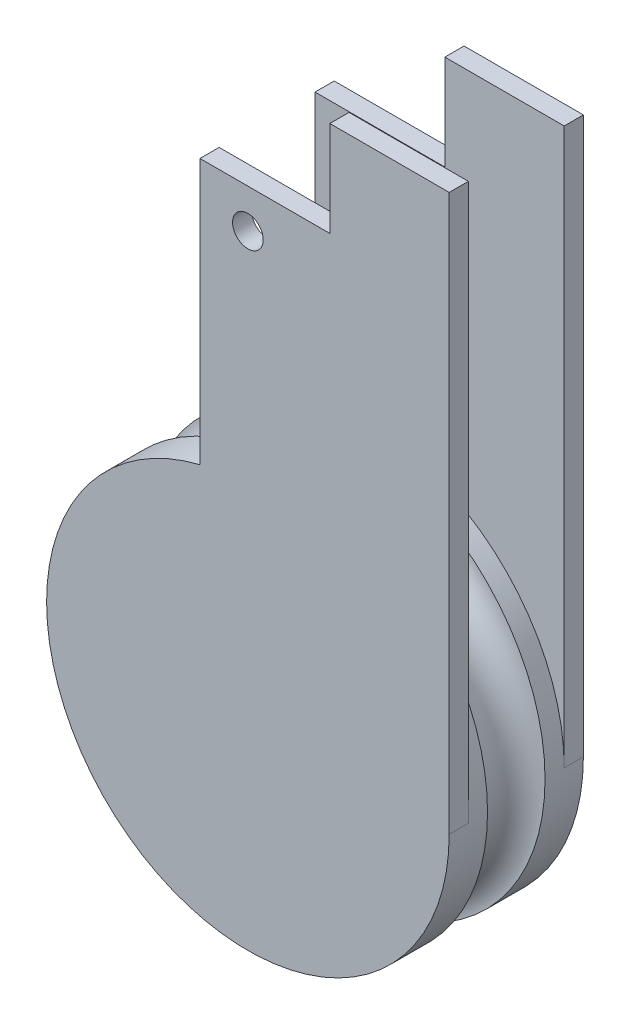
ISO-10303-21;
HEADER;
FILE_DESCRIPTION(('STEP AP214'),'2;1');
FILE_NAME('part.step','',(''),(''),'','','');
FILE_SCHEMA(('AUTOMOTIVE_DESIGN { 1 0 10303 214 1 1 1 1 }'));
ENDSEC;
DATA;
#1=APPLICATION_CONTEXT('core data for automotive mechanical design processes');
#2=APPLICATION_PROTOCOL_DEFINITION('international standard','automotive_design',2000,#1);
#3=PRODUCT_CONTEXT('',#1,'mechanical');
#4=PRODUCT('Part','Part','',(#3));
#5=PRODUCT_RELATED_PRODUCT_CATEGORY('part','',(#4));
#6=PRODUCT_DEFINITION_FORMATION('','',#4);
#7=PRODUCT_DEFINITION_CONTEXT('part definition',#1,'design');
#8=PRODUCT_DEFINITION('design','',#6,#7);
#9=PRODUCT_DEFINITION_SHAPE('','',#8);
#10=(LENGTH_UNIT() NAMED_UNIT(*) SI_UNIT(.MILLI.,.METRE.));
#11=(NAMED_UNIT(*) PLANE_ANGLE_UNIT() SI_UNIT($,.RADIAN.));
#12=(NAMED_UNIT(*) SI_UNIT($,.STERADIAN.) SOLID_ANGLE_UNIT());
#13=UNCERTAINTY_MEASURE_WITH_UNIT(LENGTH_MEASURE(1.E-05),#10,'distance_accuracy_value','');
#14=(GEOMETRIC_REPRESENTATION_CONTEXT(3) GLOBAL_UNCERTAINTY_ASSIGNED_CONTEXT((#13)) GLOBAL_UNIT_ASSIGNED_CONTEXT((#10,
#11,#12)) REPRESENTATION_CONTEXT('',''));
#15=CARTESIAN_POINT('',(0.,0.,0.));
#16=DIRECTION('',(0.,0.,1.));
#17=DIRECTION('',(1.,0.,0.));
#18=AXIS2_PLACEMENT_3D('',#15,#16,#17);
#19=CARTESIAN_POINT('',(0.,0.,5.));
#20=DIRECTION('',(0.,0.,-1.));
#21=DIRECTION('',(-1.,0.,0.));
#22=AXIS2_PLACEMENT_3D('',#19,#20,#21);
#23=CYLINDRICAL_SURFACE('',#22,105.);
#24=CARTESIAN_POINT('',(0.,0.,55.));
#25=DIRECTION('',(0.,0.,1.));
#26=DIRECTION('',(1.,0.,0.));
#27=AXIS2_PLACEMENT_3D('',#24,#25,#26);
#28=CIRCLE('',#27,105.);
#29=CARTESIAN_POINT('',(105.,0.,55.));
#30=VERTEX_POINT('',#29);
#31=CARTESIAN_POINT('',(-25.0000000000001,101.980390271856,55.));
#32=VERTEX_POINT('',#31);
#33=EDGE_CURVE('E83',#30,#32,#28,.T.);
#34=ORIENTED_EDGE('',*,*,#33,.F.);
#35=DIRECTION('',(0.,0.,-1.));
#36=VECTOR('',#35,1.);
#37=CARTESIAN_POINT('',(105.,0.,65.));
#38=LINE('',#37,#36);
#39=CARTESIAN_POINT('',(105.,0.,65.));
#40=VERTEX_POINT('',#39);
#41=EDGE_CURVE('E243',#40,#30,#38,.T.);
#42=ORIENTED_EDGE('',*,*,#41,.F.);
#43=CARTESIAN_POINT('',(0.,0.,65.));
#44=DIRECTION('',(0.,0.,1.));
#45=DIRECTION('',(1.,0.,0.));
#46=AXIS2_PLACEMENT_3D('',#43,#44,#45);
#47=CIRCLE('',#46,105.);
#48=CARTESIAN_POINT('',(-25.0000000000001,101.980390271856,65.));
#49=VERTEX_POINT('',#48);
#50=EDGE_CURVE('E207',#49,#40,#47,.T.);
#51=ORIENTED_EDGE('',*,*,#50,.F.);
#52=DIRECTION('',(0.,0.,-1.));
#53=VECTOR('',#52,1.);
#54=CARTESIAN_POINT('',(-25.0000000000001,101.980390271856,65.));
#55=LINE('',#54,#53);
#56=EDGE_CURVE('E241',#49,#32,#55,.T.);
#57=ORIENTED_EDGE('',*,*,#56,.T.);
#58=EDGE_LOOP('',(#34,#42,#51,#57));
#59=FACE_BOUND('',#58,.T.);
#60=CARTESIAN_POINT('',(0.,0.,45.));
#61=DIRECTION('',(0.,0.,-1.));
#62=DIRECTION('',(-1.,0.,0.));
#63=AXIS2_PLACEMENT_3D('',#60,#61,#62);
#64=CIRCLE('',#63,105.);
#65=CARTESIAN_POINT('',(-105.,0.,45.));
#66=VERTEX_POINT('',#65);
#67=EDGE_CURVE('E70',#66,#66,#64,.T.);
#68=ORIENTED_EDGE('',*,*,#67,.F.);
#69=EDGE_LOOP('',(#68));
#70=FACE_BOUND('',#69,.T.);
#71=ADVANCED_FACE('F67',(#59,#70),#23,.T.);
#72=CARTESIAN_POINT('',(0.,0.,55.));
#73=DIRECTION('',(0.,0.,1.));
#74=DIRECTION('',(1.,0.,0.));
#75=AXIS2_PLACEMENT_3D('',#72,#73,#74);
#76=PLANE('',#75);
#77=CARTESIAN_POINT('',(0.,220.,55.));
#78=DIRECTION('',(0.,0.,1.));
#79=DIRECTION('',(1.,0.,0.));
#80=AXIS2_PLACEMENT_3D('',#77,#78,#79);
#81=CIRCLE('',#80,8.);
#82=CARTESIAN_POINT('',(8.,220.,55.));
#83=VERTEX_POINT('',#82);
#84=EDGE_CURVE('E188',#83,#83,#81,.T.);
#85=ORIENTED_EDGE('',*,*,#84,.T.);
#86=EDGE_LOOP('',(#85));
#87=FACE_BOUND('',#86,.T.);
#88=DIRECTION('',(0.,-1.,0.));
#89=VECTOR('',#88,1.);
#90=CARTESIAN_POINT('',(105.,0.,55.));
#91=LINE('',#90,#89);
#92=CARTESIAN_POINT('',(105.,290.,55.));
#93=VERTEX_POINT('',#92);
#94=EDGE_CURVE('E222',#93,#30,#91,.T.);
#95=ORIENTED_EDGE('',*,*,#94,.T.);
#96=ORIENTED_EDGE('',*,*,#33,.T.);
#97=DIRECTION('',(0.,1.,0.));
#98=VECTOR('',#97,1.);
#99=CARTESIAN_POINT('',(-25.,0.,55.));
#100=LINE('',#99,#98);
#101=CARTESIAN_POINT('',(-25.0000000000001,240.330386365288,55.));
#102=VERTEX_POINT('',#101);
#103=EDGE_CURVE('E224',#32,#102,#100,.T.);
#104=ORIENTED_EDGE('',*,*,#103,.T.);
#105=DIRECTION('',(-1.,0.,0.));
#106=VECTOR('',#105,1.);
#107=CARTESIAN_POINT('',(0.,240.330386365288,55.));
#108=LINE('',#107,#106);
#109=CARTESIAN_POINT('',(42.7404770746346,240.330386365288,55.));
#110=VERTEX_POINT('',#109);
#111=EDGE_CURVE('E226',#110,#102,#108,.T.);
#112=ORIENTED_EDGE('',*,*,#111,.F.);
#113=DIRECTION('',(0.,-1.,0.));
#114=VECTOR('',#113,1.);
#115=CARTESIAN_POINT('',(42.7404770746346,0.,55.));
#116=LINE('',#115,#114);
#117=CARTESIAN_POINT('',(42.7404770746346,290.,55.));
#118=VERTEX_POINT('',#117);
#119=EDGE_CURVE('E204',#118,#110,#116,.T.);
#120=ORIENTED_EDGE('',*,*,#119,.F.);
#121=DIRECTION('',(1.,0.,0.));
#122=VECTOR('',#121,1.);
#123=CARTESIAN_POINT('',(0.,290.,55.));
#124=LINE('',#123,#122);
#125=EDGE_CURVE('E197',#118,#93,#124,.T.);
#126=ORIENTED_EDGE('',*,*,#125,.T.);
#127=EDGE_LOOP('',(#95,#96,#104,#112,#120,#126));
#128=FACE_BOUND('',#127,.T.);
#129=ADVANCED_FACE('F308',(#87,#128),#76,.F.);
#130=CARTESIAN_POINT('',(0.,0.,65.));
#131=DIRECTION('',(0.,0.,1.));
#132=DIRECTION('',(1.,0.,0.));
#133=AXIS2_PLACEMENT_3D('',#130,#131,#132);
#134=PLANE('',#133);
#135=DIRECTION('',(1.,0.,0.));
#136=VECTOR('',#135,1.);
#137=CARTESIAN_POINT('',(0.,290.,65.));
#138=LINE('',#137,#136);
#139=CARTESIAN_POINT('',(42.7404770746346,290.,65.));
#140=VERTEX_POINT('',#139);
#141=CARTESIAN_POINT('',(105.,290.,65.));
#142=VERTEX_POINT('',#141);
#143=EDGE_CURVE('E200',#140,#142,#138,.T.);
#144=ORIENTED_EDGE('',*,*,#143,.F.);
#145=DIRECTION('',(0.,-1.,0.));
#146=VECTOR('',#145,1.);
#147=CARTESIAN_POINT('',(42.7404770746346,0.,65.));
#148=LINE('',#147,#146);
#149=CARTESIAN_POINT('',(42.7404770746346,240.330386365288,65.));
#150=VERTEX_POINT('',#149);
#151=EDGE_CURVE('E216',#140,#150,#148,.T.);
#152=ORIENTED_EDGE('',*,*,#151,.T.);
#153=DIRECTION('',(-1.,0.,0.));
#154=VECTOR('',#153,1.);
#155=CARTESIAN_POINT('',(0.,240.330386365288,65.));
#156=LINE('',#155,#154);
#157=CARTESIAN_POINT('',(-25.0000000000001,240.330386365288,65.));
#158=VERTEX_POINT('',#157);
#159=EDGE_CURVE('E213',#150,#158,#156,.T.);
#160=ORIENTED_EDGE('',*,*,#159,.T.);
#161=DIRECTION('',(0.,1.,0.));
#162=VECTOR('',#161,1.);
#163=CARTESIAN_POINT('',(-25.,0.,65.));
#164=LINE('',#163,#162);
#165=EDGE_CURVE('E210',#49,#158,#164,.T.);
#166=ORIENTED_EDGE('',*,*,#165,.F.);
#167=ORIENTED_EDGE('',*,*,#50,.T.);
#168=DIRECTION('',(0.,-1.,0.));
#169=VECTOR('',#168,1.);
#170=CARTESIAN_POINT('',(105.,0.,65.));
#171=LINE('',#170,#169);
#172=EDGE_CURVE('E203',#142,#40,#171,.T.);
#173=ORIENTED_EDGE('',*,*,#172,.F.);
#174=EDGE_LOOP('',(#144,#152,#160,#166,#167,#173));
#175=FACE_BOUND('',#174,.T.);
#176=CARTESIAN_POINT('',(0.,220.,65.));
#177=DIRECTION('',(0.,0.,1.));
#178=DIRECTION('',(1.,0.,0.));
#179=AXIS2_PLACEMENT_3D('',#176,#177,#178);
#180=CIRCLE('',#179,8.);
#181=CARTESIAN_POINT('',(8.,220.,65.));
#182=VERTEX_POINT('',#181);
#183=EDGE_CURVE('E192',#182,#182,#180,.T.);
#184=ORIENTED_EDGE('',*,*,#183,.F.);
#185=EDGE_LOOP('',(#184));
#186=FACE_BOUND('',#185,.T.);
#187=ADVANCED_FACE('F293',(#175,#186),#134,.T.);
#188=CARTESIAN_POINT('',(0.,290.,65.));
#189=DIRECTION('',(0.,1.,0.));
#190=DIRECTION('',(0.,0.,1.));
#191=AXIS2_PLACEMENT_3D('',#188,#189,#190);
#192=PLANE('',#191);
#193=ORIENTED_EDGE('',*,*,#125,.F.);
#194=DIRECTION('',(0.,0.,-1.));
#195=VECTOR('',#194,1.);
#196=CARTESIAN_POINT('',(42.7404770746346,290.,65.));
#197=LINE('',#196,#195);
#198=EDGE_CURVE('E231',#140,#118,#197,.T.);
#199=ORIENTED_EDGE('',*,*,#198,.F.);
#200=ORIENTED_EDGE('',*,*,#143,.T.);
#201=DIRECTION('',(0.,0.,-1.));
#202=VECTOR('',#201,1.);
#203=CARTESIAN_POINT('',(105.,290.,65.));
#204=LINE('',#203,#202);
#205=EDGE_CURVE('E219',#142,#93,#204,.T.);
#206=ORIENTED_EDGE('',*,*,#205,.T.);
#207=EDGE_LOOP('',(#193,#199,#200,#206));
#208=FACE_BOUND('',#207,.T.);
#209=ADVANCED_FACE('F306',(#208),#192,.T.);
#210=CARTESIAN_POINT('',(42.7404770746346,0.,65.));
#211=DIRECTION('',(1.,0.,0.));
#212=DIRECTION('',(0.,0.,-1.));
#213=AXIS2_PLACEMENT_3D('',#210,#211,#212);
#214=PLANE('',#213);
#215=ORIENTED_EDGE('',*,*,#119,.T.);
#216=DIRECTION('',(0.,0.,-1.));
#217=VECTOR('',#216,1.);
#218=CARTESIAN_POINT('',(42.7404770746346,240.330386365288,65.));
#219=LINE('',#218,#217);
#220=EDGE_CURVE('E235',#150,#110,#219,.T.);
#221=ORIENTED_EDGE('',*,*,#220,.F.);
#222=ORIENTED_EDGE('',*,*,#151,.F.);
#223=ORIENTED_EDGE('',*,*,#198,.T.);
#224=EDGE_LOOP('',(#215,#221,#222,#223));
#225=FACE_BOUND('',#224,.T.);
#226=ADVANCED_FACE('F309',(#225),#214,.F.);
#227=CARTESIAN_POINT('',(0.,240.330386365288,65.));
#228=DIRECTION('',(0.,-1.,0.));
#229=DIRECTION('',(0.,0.,-1.));
#230=AXIS2_PLACEMENT_3D('',#227,#228,#229);
#231=PLANE('',#230);
#232=ORIENTED_EDGE('',*,*,#111,.T.);
#233=DIRECTION('',(0.,0.,-1.));
#234=VECTOR('',#233,1.);
#235=CARTESIAN_POINT('',(-25.0000000000001,240.330386365288,65.));
#236=LINE('',#235,#234);
#237=EDGE_CURVE('E238',#158,#102,#236,.T.);
#238=ORIENTED_EDGE('',*,*,#237,.F.);
#239=ORIENTED_EDGE('',*,*,#159,.F.);
#240=ORIENTED_EDGE('',*,*,#220,.T.);
#241=EDGE_LOOP('',(#232,#238,#239,#240));
#242=FACE_BOUND('',#241,.T.);
#243=ADVANCED_FACE('F297',(#242),#231,.F.);
#244=CARTESIAN_POINT('',(-25.,0.,65.));
#245=DIRECTION('',(-1.,0.,0.));
#246=DIRECTION('',(0.,-1.,0.));
#247=AXIS2_PLACEMENT_3D('',#244,#245,#246);
#248=PLANE('',#247);
#249=ORIENTED_EDGE('',*,*,#103,.F.);
#250=ORIENTED_EDGE('',*,*,#56,.F.);
#251=ORIENTED_EDGE('',*,*,#165,.T.);
#252=ORIENTED_EDGE('',*,*,#237,.T.);
#253=EDGE_LOOP('',(#249,#250,#251,#252));
#254=FACE_BOUND('',#253,.T.);
#255=ADVANCED_FACE('F301',(#254),#248,.T.);
#256=CARTESIAN_POINT('',(105.,0.,65.));
#257=DIRECTION('',(1.,0.,0.));
#258=DIRECTION('',(0.,1.,0.));
#259=AXIS2_PLACEMENT_3D('',#256,#257,#258);
#260=PLANE('',#259);
#261=ORIENTED_EDGE('',*,*,#94,.F.);
#262=ORIENTED_EDGE('',*,*,#205,.F.);
#263=ORIENTED_EDGE('',*,*,#172,.T.);
#264=ORIENTED_EDGE('',*,*,#41,.T.);
#265=EDGE_LOOP('',(#261,#262,#263,#264));
#266=FACE_BOUND('',#265,.T.);
#267=ADVANCED_FACE('F307',(#266),#260,.T.);
#268=CARTESIAN_POINT('',(0.,220.,65.));
#269=DIRECTION('',(0.,0.,-1.));
#270=DIRECTION('',(-1.,0.,0.));
#271=AXIS2_PLACEMENT_3D('',#268,#269,#270);
#272=CYLINDRICAL_SURFACE('',#271,8.);
#273=ORIENTED_EDGE('',*,*,#183,.T.);
#274=EDGE_LOOP('',(#273));
#275=FACE_BOUND('',#274,.T.);
#276=ORIENTED_EDGE('',*,*,#84,.F.);
#277=EDGE_LOOP('',(#276));
#278=FACE_BOUND('',#277,.T.);
#279=ADVANCED_FACE('F423',(#275,#278),#272,.F.);
#280=CARTESIAN_POINT('',(0.,0.,30.));
#281=DIRECTION('',(0.,0.,1.));
#282=DIRECTION('',(1.,0.,0.));
#283=AXIS2_PLACEMENT_3D('',#280,#281,#282);
#284=TOROIDAL_SURFACE('',#283,105.,15.);
#285=CARTESIAN_POINT('',(0.,0.,15.));
#286=DIRECTION('',(0.,0.,1.));
#287=DIRECTION('',(1.,0.,0.));
#288=AXIS2_PLACEMENT_3D('',#285,#286,#287);
#289=CIRCLE('',#288,105.);
#290=CARTESIAN_POINT('',(105.,0.,15.));
#291=VERTEX_POINT('',#290);
#292=EDGE_CURVE('E183',#291,#291,#289,.T.);
#293=ORIENTED_EDGE('',*,*,#292,.T.);
#294=EDGE_LOOP('',(#293));
#295=FACE_BOUND('',#294,.T.);
#296=ORIENTED_EDGE('',*,*,#67,.T.);
#297=EDGE_LOOP('',(#296));
#298=FACE_BOUND('',#297,.T.);
#299=ADVANCED_FACE('F342',(#295,#298),#284,.F.);
#300=CARTESIAN_POINT('',(0.,220.,5.));
#301=DIRECTION('',(0.,0.,-1.));
#302=DIRECTION('',(-1.,0.,0.));
#303=AXIS2_PLACEMENT_3D('',#300,#301,#302);
#304=CYLINDRICAL_SURFACE('',#303,8.);
#305=CARTESIAN_POINT('',(0.,220.,5.));
#306=DIRECTION('',(0.,0.,1.));
#307=DIRECTION('',(1.,0.,0.));
#308=AXIS2_PLACEMENT_3D('',#305,#306,#307);
#309=CIRCLE('',#308,8.);
#310=CARTESIAN_POINT('',(8.,220.,5.));
#311=VERTEX_POINT('',#310);
#312=EDGE_CURVE('E157',#311,#311,#309,.T.);
#313=ORIENTED_EDGE('',*,*,#312,.T.);
#314=EDGE_LOOP('',(#313));
#315=FACE_BOUND('',#314,.T.);
#316=CARTESIAN_POINT('',(0.,220.,-5.));
#317=DIRECTION('',(0.,0.,1.));
#318=DIRECTION('',(1.,0.,0.));
#319=AXIS2_PLACEMENT_3D('',#316,#317,#318);
#320=CIRCLE('',#319,8.);
#321=CARTESIAN_POINT('',(8.,220.,-5.));
#322=VERTEX_POINT('',#321);
#323=EDGE_CURVE('E176',#322,#322,#320,.T.);
#324=ORIENTED_EDGE('',*,*,#323,.F.);
#325=EDGE_LOOP('',(#324));
#326=FACE_BOUND('',#325,.T.);
#327=ADVANCED_FACE('F338',(#315,#326),#304,.F.);
#328=CARTESIAN_POINT('',(0.,290.,5.));
#329=DIRECTION('',(0.,-1.,0.));
#330=DIRECTION('',(0.,0.,-1.));
#331=AXIS2_PLACEMENT_3D('',#328,#329,#330);
#332=PLANE('',#331);
#333=DIRECTION('',(-1.,0.,0.));
#334=VECTOR('',#333,1.);
#335=CARTESIAN_POINT('',(0.,290.,-5.));
#336=LINE('',#335,#334);
#337=CARTESIAN_POINT('',(105.,290.,-5.));
#338=VERTEX_POINT('',#337);
#339=CARTESIAN_POINT('',(42.7404770746346,290.,-5.));
#340=VERTEX_POINT('',#339);
#341=EDGE_CURVE('E169',#338,#340,#336,.T.);
#342=ORIENTED_EDGE('',*,*,#341,.T.);
#343=DIRECTION('',(0.,0.,-1.));
#344=VECTOR('',#343,1.);
#345=CARTESIAN_POINT('',(42.7404770746346,290.,5.));
#346=LINE('',#345,#344);
#347=CARTESIAN_POINT('',(42.7404770746346,290.,5.));
#348=VERTEX_POINT('',#347);
#349=EDGE_CURVE('E145',#348,#340,#346,.T.);
#350=ORIENTED_EDGE('',*,*,#349,.F.);
#351=DIRECTION('',(-1.,0.,0.));
#352=VECTOR('',#351,1.);
#353=CARTESIAN_POINT('',(0.,290.,5.));
#354=LINE('',#353,#352);
#355=CARTESIAN_POINT('',(105.,290.,5.));
#356=VERTEX_POINT('',#355);
#357=EDGE_CURVE('E152',#356,#348,#354,.T.);
#358=ORIENTED_EDGE('',*,*,#357,.F.);
#359=DIRECTION('',(0.,0.,-1.));
#360=VECTOR('',#359,1.);
#361=CARTESIAN_POINT('',(105.,290.,5.));
#362=LINE('',#361,#360);
#363=EDGE_CURVE('E75',#356,#338,#362,.T.);
#364=ORIENTED_EDGE('',*,*,#363,.T.);
#365=EDGE_LOOP('',(#342,#350,#358,#364));
#366=FACE_BOUND('',#365,.T.);
#367=ADVANCED_FACE('F341',(#366),#332,.F.);
#368=CARTESIAN_POINT('',(42.7404770746346,0.,5.));
#369=DIRECTION('',(-1.,0.,0.));
#370=DIRECTION('',(0.,0.,1.));
#371=AXIS2_PLACEMENT_3D('',#368,#369,#370);
#372=PLANE('',#371);
#373=DIRECTION('',(0.,1.,0.));
#374=VECTOR('',#373,1.);
#375=CARTESIAN_POINT('',(42.7404770746346,0.,-5.));
#376=LINE('',#375,#374);
#377=CARTESIAN_POINT('',(42.7404770746346,240.330386365288,-5.));
#378=VERTEX_POINT('',#377);
#379=EDGE_CURVE('E140',#378,#340,#376,.T.);
#380=ORIENTED_EDGE('',*,*,#379,.F.);
#381=DIRECTION('',(0.,0.,-1.));
#382=VECTOR('',#381,1.);
#383=CARTESIAN_POINT('',(42.7404770746346,240.330386365288,5.));
#384=LINE('',#383,#382);
#385=CARTESIAN_POINT('',(42.7404770746346,240.330386365288,5.));
#386=VERTEX_POINT('',#385);
#387=EDGE_CURVE('E135',#386,#378,#384,.T.);
#388=ORIENTED_EDGE('',*,*,#387,.F.);
#389=DIRECTION('',(0.,1.,0.));
#390=VECTOR('',#389,1.);
#391=CARTESIAN_POINT('',(42.7404770746346,0.,5.));
#392=LINE('',#391,#390);
#393=EDGE_CURVE('E138',#386,#348,#392,.T.);
#394=ORIENTED_EDGE('',*,*,#393,.T.);
#395=ORIENTED_EDGE('',*,*,#349,.T.);
#396=EDGE_LOOP('',(#380,#388,#394,#395));
#397=FACE_BOUND('',#396,.T.);
#398=ADVANCED_FACE('F137',(#397),#372,.T.);
#399=CARTESIAN_POINT('',(0.,240.330386365288,5.));
#400=DIRECTION('',(0.,1.,0.));
#401=DIRECTION('',(0.,0.,1.));
#402=AXIS2_PLACEMENT_3D('',#399,#400,#401);
#403=PLANE('',#402);
#404=DIRECTION('',(1.,0.,0.));
#405=VECTOR('',#404,1.);
#406=CARTESIAN_POINT('',(0.,240.330386365288,-5.));
#407=LINE('',#406,#405);
#408=CARTESIAN_POINT('',(-25.0000000000001,240.330386365288,-5.));
#409=VERTEX_POINT('',#408);
#410=EDGE_CURVE('E173',#409,#378,#407,.T.);
#411=ORIENTED_EDGE('',*,*,#410,.F.);
#412=DIRECTION('',(0.,0.,-1.));
#413=VECTOR('',#412,1.);
#414=CARTESIAN_POINT('',(-25.0000000000001,240.330386365288,5.));
#415=LINE('',#414,#413);
#416=CARTESIAN_POINT('',(-25.0000000000001,240.330386365288,5.));
#417=VERTEX_POINT('',#416);
#418=EDGE_CURVE('E146',#417,#409,#415,.T.);
#419=ORIENTED_EDGE('',*,*,#418,.F.);
#420=DIRECTION('',(1.,0.,0.));
#421=VECTOR('',#420,1.);
#422=CARTESIAN_POINT('',(0.,240.330386365288,5.));
#423=LINE('',#422,#421);
#424=EDGE_CURVE('E150',#417,#386,#423,.T.);
#425=ORIENTED_EDGE('',*,*,#424,.T.);
#426=ORIENTED_EDGE('',*,*,#387,.T.);
#427=EDGE_LOOP('',(#411,#419,#425,#426));
#428=FACE_BOUND('',#427,.T.);
#429=ADVANCED_FACE('F155',(#428),#403,.T.);
#430=CARTESIAN_POINT('',(-25.,0.,5.));
#431=DIRECTION('',(1.,0.,0.));
#432=DIRECTION('',(0.,1.,0.));
#433=AXIS2_PLACEMENT_3D('',#430,#431,#432);
#434=PLANE('',#433);
#435=DIRECTION('',(0.,-1.,0.));
#436=VECTOR('',#435,1.);
#437=CARTESIAN_POINT('',(-25.,0.,-5.));
#438=LINE('',#437,#436);
#439=CARTESIAN_POINT('',(-25.0000000000001,101.980390271856,-5.));
#440=VERTEX_POINT('',#439);
#441=EDGE_CURVE('E119',#409,#440,#438,.T.);
#442=ORIENTED_EDGE('',*,*,#441,.T.);
#443=DIRECTION('',(0.,0.,-1.));
#444=VECTOR('',#443,1.);
#445=CARTESIAN_POINT('',(-25.0000000000001,101.980390271856,5.));
#446=LINE('',#445,#444);
#447=CARTESIAN_POINT('',(-25.0000000000001,101.980390271856,5.));
#448=VERTEX_POINT('',#447);
#449=EDGE_CURVE('E163',#448,#440,#446,.T.);
#450=ORIENTED_EDGE('',*,*,#449,.F.);
#451=DIRECTION('',(0.,-1.,0.));
#452=VECTOR('',#451,1.);
#453=CARTESIAN_POINT('',(-25.,0.,5.));
#454=LINE('',#453,#452);
#455=EDGE_CURVE('E92',#417,#448,#454,.T.);
#456=ORIENTED_EDGE('',*,*,#455,.F.);
#457=ORIENTED_EDGE('',*,*,#418,.T.);
#458=EDGE_LOOP('',(#442,#450,#456,#457));
#459=FACE_BOUND('',#458,.T.);
#460=ADVANCED_FACE('F344',(#459),#434,.F.);
#461=CARTESIAN_POINT('',(0.,0.,5.));
#462=DIRECTION('',(0.,0.,1.));
#463=DIRECTION('',(1.,0.,0.));
#464=AXIS2_PLACEMENT_3D('',#461,#462,#463);
#465=PLANE('',#464);
#466=CARTESIAN_POINT('',(0.,0.,5.));
#467=DIRECTION('',(0.,0.,1.));
#468=DIRECTION('',(1.,0.,0.));
#469=AXIS2_PLACEMENT_3D('',#466,#467,#468);
#470=CIRCLE('',#469,105.);
#471=CARTESIAN_POINT('',(105.,0.,5.));
#472=VERTEX_POINT('',#471);
#473=EDGE_CURVE('E234',#472,#448,#470,.T.);
#474=ORIENTED_EDGE('',*,*,#473,.F.);
#475=DIRECTION('',(0.,1.,0.));
#476=VECTOR('',#475,1.);
#477=CARTESIAN_POINT('',(105.,0.,5.));
#478=LINE('',#477,#476);
#479=EDGE_CURVE('E126',#472,#356,#478,.T.);
#480=ORIENTED_EDGE('',*,*,#479,.T.);
#481=ORIENTED_EDGE('',*,*,#357,.T.);
#482=ORIENTED_EDGE('',*,*,#393,.F.);
#483=ORIENTED_EDGE('',*,*,#424,.F.);
#484=ORIENTED_EDGE('',*,*,#455,.T.);
#485=EDGE_LOOP('',(#474,#480,#481,#482,#483,#484));
#486=FACE_BOUND('',#485,.T.);
#487=ORIENTED_EDGE('',*,*,#312,.F.);
#488=EDGE_LOOP('',(#487));
#489=FACE_BOUND('',#488,.T.);
#490=ADVANCED_FACE('F148',(#486,#489),#465,.T.);
#491=CARTESIAN_POINT('',(105.,0.,5.));
#492=DIRECTION('',(-1.,0.,0.));
#493=DIRECTION('',(0.,-1.,0.));
#494=AXIS2_PLACEMENT_3D('',#491,#492,#493);
#495=PLANE('',#494);
#496=DIRECTION('',(0.,1.,0.));
#497=VECTOR('',#496,1.);
#498=CARTESIAN_POINT('',(105.,0.,-5.));
#499=LINE('',#498,#497);
#500=CARTESIAN_POINT('',(105.,0.,-5.));
#501=VERTEX_POINT('',#500);
#502=EDGE_CURVE('E167',#501,#338,#499,.T.);
#503=ORIENTED_EDGE('',*,*,#502,.T.);
#504=ORIENTED_EDGE('',*,*,#363,.F.);
#505=ORIENTED_EDGE('',*,*,#479,.F.);
#506=DIRECTION('',(0.,0.,-1.));
#507=VECTOR('',#506,1.);
#508=CARTESIAN_POINT('',(105.,0.,5.));
#509=LINE('',#508,#507);
#510=EDGE_CURVE('E12',#472,#501,#509,.T.);
#511=ORIENTED_EDGE('',*,*,#510,.T.);
#512=EDGE_LOOP('',(#503,#504,#505,#511));
#513=FACE_BOUND('',#512,.T.);
#514=ADVANCED_FACE('F327',(#513),#495,.F.);
#515=CARTESIAN_POINT('',(0.,0.,-5.));
#516=DIRECTION('',(0.,0.,1.));
#517=DIRECTION('',(1.,0.,0.));
#518=AXIS2_PLACEMENT_3D('',#515,#516,#517);
#519=PLANE('',#518);
#520=CARTESIAN_POINT('',(0.,0.,-5.));
#521=DIRECTION('',(0.,0.,1.));
#522=DIRECTION('',(1.,0.,0.));
#523=AXIS2_PLACEMENT_3D('',#520,#521,#522);
#524=CIRCLE('',#523,105.);
#525=EDGE_CURVE('E164',#440,#501,#524,.T.);
#526=ORIENTED_EDGE('',*,*,#525,.F.);
#527=ORIENTED_EDGE('',*,*,#441,.F.);
#528=ORIENTED_EDGE('',*,*,#410,.T.);
#529=ORIENTED_EDGE('',*,*,#379,.T.);
#530=ORIENTED_EDGE('',*,*,#341,.F.);
#531=ORIENTED_EDGE('',*,*,#502,.F.);
#532=EDGE_LOOP('',(#526,#527,#528,#529,#530,#531));
#533=FACE_BOUND('',#532,.T.);
#534=ORIENTED_EDGE('',*,*,#323,.T.);
#535=EDGE_LOOP('',(#534));
#536=FACE_BOUND('',#535,.T.);
#537=ADVANCED_FACE('F324',(#533,#536),#519,.F.);
#538=ORIENTED_EDGE('',*,*,#525,.T.);
#539=ORIENTED_EDGE('',*,*,#510,.F.);
#540=ORIENTED_EDGE('',*,*,#473,.T.);
#541=ORIENTED_EDGE('',*,*,#449,.T.);
#542=EDGE_LOOP('',(#538,#539,#540,#541));
#543=FACE_BOUND('',#542,.T.);
#544=ORIENTED_EDGE('',*,*,#292,.F.);
#545=EDGE_LOOP('',(#544));
#546=FACE_BOUND('',#545,.T.);
#547=ADVANCED_FACE('F253',(#543,#546),#23,.T.);
#548=CLOSED_SHELL('',(#71,#129,#187,#209,#226,#243,#255,#267,#279,#299,#327,#367,#398,#429,#460,
#490,#514,#537,#547));
#549=MANIFOLD_SOLID_BREP('B2',#548);
#550=ADVANCED_BREP_SHAPE_REPRESENTATION('',(#18,#549),#14);
#551=SHAPE_DEFINITION_REPRESENTATION(#9,#550);
ENDSEC;
END-ISO-10303-21;
